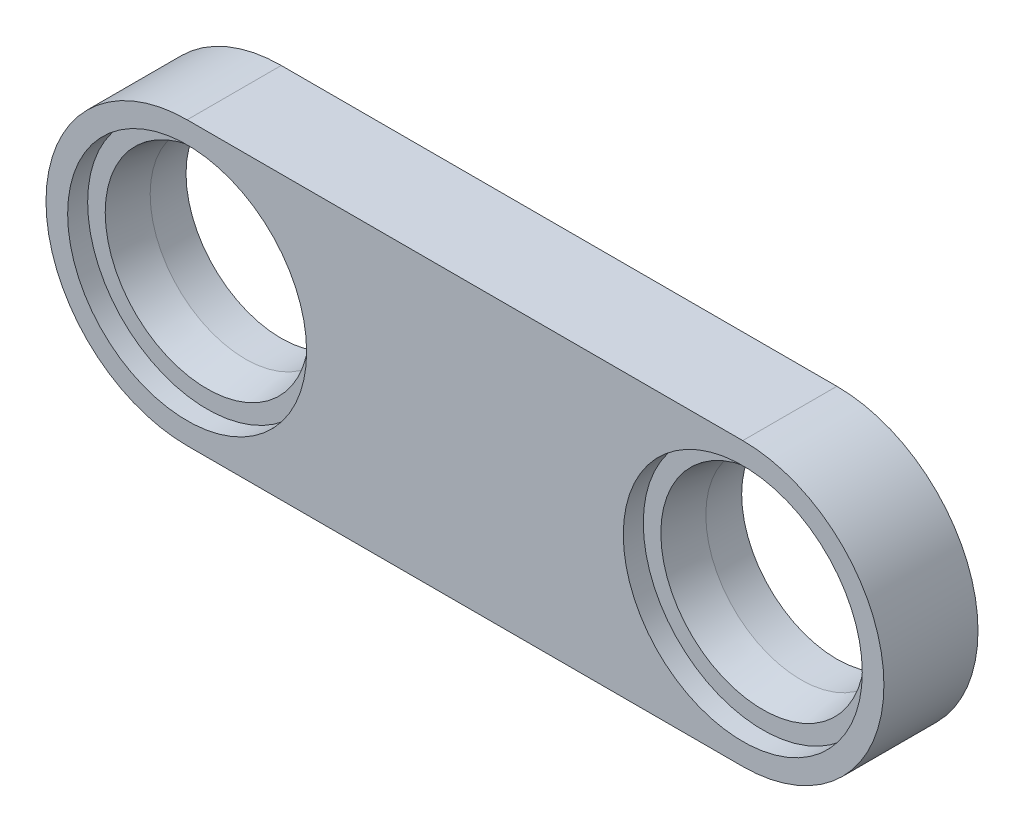
ISO-10303-21;
HEADER;
FILE_DESCRIPTION(('STEP AP214'),'2;1');
FILE_NAME('part.step','',(''),(''),'','','');
FILE_SCHEMA(('AUTOMOTIVE_DESIGN { 1 0 10303 214 1 1 1 1 }'));
ENDSEC;
DATA;
#1=APPLICATION_CONTEXT('core data for automotive mechanical design processes');
#2=APPLICATION_PROTOCOL_DEFINITION('international standard','automotive_design',2000,#1);
#3=PRODUCT_CONTEXT('',#1,'mechanical');
#4=PRODUCT('Part','Part','',(#3));
#5=PRODUCT_RELATED_PRODUCT_CATEGORY('part','',(#4));
#6=PRODUCT_DEFINITION_FORMATION('','',#4);
#7=PRODUCT_DEFINITION_CONTEXT('part definition',#1,'design');
#8=PRODUCT_DEFINITION('design','',#6,#7);
#9=PRODUCT_DEFINITION_SHAPE('','',#8);
#10=(LENGTH_UNIT() NAMED_UNIT(*) SI_UNIT(.MILLI.,.METRE.));
#11=(NAMED_UNIT(*) PLANE_ANGLE_UNIT() SI_UNIT($,.RADIAN.));
#12=(NAMED_UNIT(*) SI_UNIT($,.STERADIAN.) SOLID_ANGLE_UNIT());
#13=UNCERTAINTY_MEASURE_WITH_UNIT(LENGTH_MEASURE(1.E-05),#10,'distance_accuracy_value','');
#14=(GEOMETRIC_REPRESENTATION_CONTEXT(3) GLOBAL_UNCERTAINTY_ASSIGNED_CONTEXT((#13)) GLOBAL_UNIT_ASSIGNED_CONTEXT((#10,
#11,#12)) REPRESENTATION_CONTEXT('',''));
#15=CARTESIAN_POINT('',(0.,0.,0.));
#16=DIRECTION('',(0.,0.,1.));
#17=DIRECTION('',(1.,0.,0.));
#18=AXIS2_PLACEMENT_3D('',#15,#16,#17);
#19=CARTESIAN_POINT('',(37.4999999999996,-4.88498130835069E-12,-12.6999999999992));
#20=DIRECTION('',(0.,0.,1.));
#21=DIRECTION('',(1.00000000000001,0.,0.));
#22=AXIS2_PLACEMENT_3D('',#19,#20,#21);
#23=CYLINDRICAL_SURFACE('',#22,19.05);
#24=CARTESIAN_POINT('',(37.5000000000017,9.76996261670138E-12,1.45716771982052E-12));
#25=DIRECTION('',(0.,0.,1.));
#26=DIRECTION('',(1.00000000000001,0.,0.));
#27=AXIS2_PLACEMENT_3D('',#24,#25,#26);
#28=CIRCLE('',#27,19.05);
#29=CARTESIAN_POINT('',(37.4999999999987,-19.0500000000022,-1.66533453693773E-12));
#30=VERTEX_POINT('',#29);
#31=CARTESIAN_POINT('',(37.5000000000019,19.0500000000089,4.57966997657877E-13));
#32=VERTEX_POINT('',#31);
#33=EDGE_CURVE('E80',#30,#32,#28,.T.);
#34=ORIENTED_EDGE('',*,*,#33,.F.);
#35=DIRECTION('',(0.,0.,1.));
#36=VECTOR('',#35,1.);
#37=CARTESIAN_POINT('',(37.5000000000005,-19.0500000000045,-12.7000000000025));
#38=LINE('',#37,#36);
#39=CARTESIAN_POINT('',(37.5000000000005,-19.0500000000045,-12.7000000000025));
#40=VERTEX_POINT('',#39);
#41=EDGE_CURVE('E10',#40,#30,#38,.T.);
#42=ORIENTED_EDGE('',*,*,#41,.F.);
#43=CARTESIAN_POINT('',(37.4999999999996,-4.88498130835069E-12,-12.6999999999992));
#44=DIRECTION('',(0.,0.,1.));
#45=DIRECTION('',(1.00000000000001,0.,0.));
#46=AXIS2_PLACEMENT_3D('',#43,#44,#45);
#47=CIRCLE('',#46,19.05);
#48=CARTESIAN_POINT('',(37.5000000000006,19.0500000000058,-12.6999999999998));
#49=VERTEX_POINT('',#48);
#50=EDGE_CURVE('E73',#40,#49,#47,.T.);
#51=ORIENTED_EDGE('',*,*,#50,.T.);
#52=DIRECTION('',(0.,0.,1.));
#53=VECTOR('',#52,1.);
#54=CARTESIAN_POINT('',(37.5000000000006,19.0500000000058,-12.6999999999998));
#55=LINE('',#54,#53);
#56=EDGE_CURVE('E18',#49,#32,#55,.T.);
#57=ORIENTED_EDGE('',*,*,#56,.T.);
#58=EDGE_LOOP('',(#34,#42,#51,#57));
#59=FACE_BOUND('',#58,.T.);
#60=ADVANCED_FACE('F15',(#59),#23,.T.);
#61=CARTESIAN_POINT('',(-37.499999999999,-19.049999999996,-12.7000000000011));
#62=DIRECTION('',(0.,-0.999999999999996,0.));
#63=DIRECTION('',(1.00000000000001,0.,0.));
#64=AXIS2_PLACEMENT_3D('',#61,#62,#63);
#65=PLANE('',#64);
#66=DIRECTION('',(1.00000000000001,0.,0.));
#67=VECTOR('',#66,1.);
#68=CARTESIAN_POINT('',(-37.5000000000006,-19.049999999996,-8.74300631892311E-13));
#69=LINE('',#68,#67);
#70=CARTESIAN_POINT('',(-37.5000000000006,-19.049999999996,-8.74300631892311E-13));
#71=VERTEX_POINT('',#70);
#72=EDGE_CURVE('E75',#71,#30,#69,.T.);
#73=ORIENTED_EDGE('',*,*,#72,.F.);
#74=DIRECTION('',(0.,0.,1.));
#75=VECTOR('',#74,1.);
#76=CARTESIAN_POINT('',(-37.499999999999,-19.049999999996,-12.7000000000011));
#77=LINE('',#76,#75);
#78=CARTESIAN_POINT('',(-37.499999999999,-19.049999999996,-12.7000000000011));
#79=VERTEX_POINT('',#78);
#80=EDGE_CURVE('E24',#79,#71,#77,.T.);
#81=ORIENTED_EDGE('',*,*,#80,.F.);
#82=DIRECTION('',(1.00000000000001,0.,0.));
#83=VECTOR('',#82,1.);
#84=CARTESIAN_POINT('',(-37.499999999999,-19.049999999996,-12.7000000000011));
#85=LINE('',#84,#83);
#86=EDGE_CURVE('E70',#79,#40,#85,.T.);
#87=ORIENTED_EDGE('',*,*,#86,.T.);
#88=ORIENTED_EDGE('',*,*,#41,.T.);
#89=EDGE_LOOP('',(#73,#81,#87,#88));
#90=FACE_BOUND('',#89,.T.);
#91=ADVANCED_FACE('F91',(#90),#65,.T.);
#92=CARTESIAN_POINT('',(-37.5000000000001,0.,-12.7000000000013));
#93=DIRECTION('',(0.,0.,1.));
#94=DIRECTION('',(1.00000000000001,0.,0.));
#95=AXIS2_PLACEMENT_3D('',#92,#93,#94);
#96=CYLINDRICAL_SURFACE('',#95,19.05);
#97=CARTESIAN_POINT('',(-37.5000000000001,7.54951656745106E-12,-1.99840144432528E-12));
#98=DIRECTION('',(0.,0.,1.));
#99=DIRECTION('',(1.00000000000001,0.,0.));
#100=AXIS2_PLACEMENT_3D('',#97,#98,#99);
#101=CIRCLE('',#100,19.05);
#102=CARTESIAN_POINT('',(-37.4999999999984,19.0500000000022,-1.66533453693773E-12));
#103=VERTEX_POINT('',#102);
#104=EDGE_CURVE('E65',#103,#71,#101,.T.);
#105=ORIENTED_EDGE('',*,*,#104,.F.);
#106=DIRECTION('',(0.,0.,1.));
#107=VECTOR('',#106,1.);
#108=CARTESIAN_POINT('',(-37.5000000000016,19.050000000008,-12.7000000000006));
#109=LINE('',#108,#107);
#110=CARTESIAN_POINT('',(-37.5000000000016,19.050000000008,-12.7000000000006));
#111=VERTEX_POINT('',#110);
#112=EDGE_CURVE('E60',#111,#103,#109,.T.);
#113=ORIENTED_EDGE('',*,*,#112,.F.);
#114=CARTESIAN_POINT('',(-37.5000000000001,0.,-12.7000000000013));
#115=DIRECTION('',(0.,0.,1.));
#116=DIRECTION('',(1.00000000000001,0.,0.));
#117=AXIS2_PLACEMENT_3D('',#114,#115,#116);
#118=CIRCLE('',#117,19.05);
#119=EDGE_CURVE('E63',#111,#79,#118,.T.);
#120=ORIENTED_EDGE('',*,*,#119,.T.);
#121=ORIENTED_EDGE('',*,*,#80,.T.);
#122=EDGE_LOOP('',(#105,#113,#120,#121));
#123=FACE_BOUND('',#122,.T.);
#124=ADVANCED_FACE('F62',(#123),#96,.T.);
#125=CARTESIAN_POINT('',(-37.5000000000016,19.050000000008,-12.7000000000006));
#126=DIRECTION('',(0.,0.999999999999996,0.));
#127=DIRECTION('',(-1.00000000000001,0.,0.));
#128=AXIS2_PLACEMENT_3D('',#125,#126,#127);
#129=PLANE('',#128);
#130=DIRECTION('',(-1.00000000000001,0.,0.));
#131=VECTOR('',#130,1.);
#132=CARTESIAN_POINT('',(-37.4999999999984,19.0500000000022,-1.66533453693773E-12));
#133=LINE('',#132,#131);
#134=EDGE_CURVE('E83',#32,#103,#133,.T.);
#135=ORIENTED_EDGE('',*,*,#134,.F.);
#136=ORIENTED_EDGE('',*,*,#56,.F.);
#137=DIRECTION('',(-1.00000000000001,0.,0.));
#138=VECTOR('',#137,1.);
#139=CARTESIAN_POINT('',(-37.5000000000016,19.050000000008,-12.7000000000006));
#140=LINE('',#139,#138);
#141=EDGE_CURVE('E69',#49,#111,#140,.T.);
#142=ORIENTED_EDGE('',*,*,#141,.T.);
#143=ORIENTED_EDGE('',*,*,#112,.T.);
#144=EDGE_LOOP('',(#135,#136,#142,#143));
#145=FACE_BOUND('',#144,.T.);
#146=ADVANCED_FACE('F72',(#145),#129,.T.);
#147=CARTESIAN_POINT('',(37.4999999999996,-4.88498130835069E-12,-12.6999999999992));
#148=DIRECTION('',(0.,0.,1.));
#149=DIRECTION('',(1.00000000000001,0.,0.));
#150=AXIS2_PLACEMENT_3D('',#147,#148,#149);
#151=PLANE('',#150);
#152=CARTESIAN_POINT('',(-37.5000000000001,0.,-12.7000000000013));
#153=DIRECTION('',(0.,0.,-1.));
#154=DIRECTION('',(-1.00000000000001,0.,0.));
#155=AXIS2_PLACEMENT_3D('',#152,#153,#154);
#156=CIRCLE('',#155,12.85);
#157=CARTESIAN_POINT('',(-50.3500000000003,0.,-12.7000000000013));
#158=VERTEX_POINT('',#157);
#159=EDGE_CURVE('E163',#158,#158,#156,.T.);
#160=ORIENTED_EDGE('',*,*,#159,.F.);
#161=EDGE_LOOP('',(#160));
#162=FACE_BOUND('',#161,.T.);
#163=CARTESIAN_POINT('',(37.4999999999996,-4.88498130835069E-12,-12.6999999999992));
#164=DIRECTION('',(0.,0.,-1.));
#165=DIRECTION('',(-1.00000000000001,0.,0.));
#166=AXIS2_PLACEMENT_3D('',#163,#164,#165);
#167=CIRCLE('',#166,12.85);
#168=CARTESIAN_POINT('',(24.6499999999995,-4.89389778701721E-12,-12.6999999999992));
#169=VERTEX_POINT('',#168);
#170=EDGE_CURVE('E84',#169,#169,#167,.T.);
#171=ORIENTED_EDGE('',*,*,#170,.F.);
#172=EDGE_LOOP('',(#171));
#173=FACE_BOUND('',#172,.T.);
#174=ORIENTED_EDGE('',*,*,#50,.F.);
#175=ORIENTED_EDGE('',*,*,#86,.F.);
#176=ORIENTED_EDGE('',*,*,#119,.F.);
#177=ORIENTED_EDGE('',*,*,#141,.F.);
#178=EDGE_LOOP('',(#174,#175,#176,#177));
#179=FACE_BOUND('',#178,.T.);
#180=ADVANCED_FACE('F68',(#162,#173,#179),#151,.F.);
#181=CARTESIAN_POINT('',(37.5000000000017,9.76996261670138E-12,1.45716771982052E-12));
#182=DIRECTION('',(0.,0.,1.));
#183=DIRECTION('',(1.00000000000001,0.,0.));
#184=AXIS2_PLACEMENT_3D('',#181,#182,#183);
#185=PLANE('',#184);
#186=CARTESIAN_POINT('',(-37.5000000000001,7.54951656745106E-12,-1.99840144432528E-12));
#187=DIRECTION('',(0.,0.,-1.));
#188=DIRECTION('',(-1.00000000000001,0.,0.));
#189=AXIS2_PLACEMENT_3D('',#186,#187,#188);
#190=CIRCLE('',#189,16.13);
#191=CARTESIAN_POINT('',(-53.6300000000003,7.53832413158406E-12,-2.04854355700945E-12));
#192=VERTEX_POINT('',#191);
#193=EDGE_CURVE('E150',#192,#192,#190,.T.);
#194=ORIENTED_EDGE('',*,*,#193,.T.);
#195=EDGE_LOOP('',(#194));
#196=FACE_BOUND('',#195,.T.);
#197=CARTESIAN_POINT('',(37.5000000000017,9.76996261670138E-12,1.45716771982052E-12));
#198=DIRECTION('',(0.,0.,-1.));
#199=DIRECTION('',(-1.00000000000001,0.,0.));
#200=AXIS2_PLACEMENT_3D('',#197,#198,#199);
#201=CIRCLE('',#200,16.13);
#202=CARTESIAN_POINT('',(21.3700000000015,9.75877018083438E-12,1.40702560713635E-12));
#203=VERTEX_POINT('',#202);
#204=EDGE_CURVE('E166',#203,#203,#201,.T.);
#205=ORIENTED_EDGE('',*,*,#204,.T.);
#206=EDGE_LOOP('',(#205));
#207=FACE_BOUND('',#206,.T.);
#208=ORIENTED_EDGE('',*,*,#33,.T.);
#209=ORIENTED_EDGE('',*,*,#134,.T.);
#210=ORIENTED_EDGE('',*,*,#104,.T.);
#211=ORIENTED_EDGE('',*,*,#72,.T.);
#212=EDGE_LOOP('',(#208,#209,#210,#211));
#213=FACE_BOUND('',#212,.T.);
#214=ADVANCED_FACE('F90',(#196,#207,#213),#185,.T.);
#215=CARTESIAN_POINT('',(37.5000000000017,9.76996261670138E-12,1.45716771982052E-12));
#216=DIRECTION('',(0.,0.,-1.));
#217=DIRECTION('',(-1.00000000000001,0.,0.));
#218=AXIS2_PLACEMENT_3D('',#215,#216,#217);
#219=CYLINDRICAL_SURFACE('',#218,12.85);
#220=CARTESIAN_POINT('',(37.4999999999994,-4.44089209850063E-13,-7.86086645585114));
#221=DIRECTION('',(0.,0.,-1.));
#222=DIRECTION('',(-1.00000000000001,0.,0.));
#223=AXIS2_PLACEMENT_3D('',#220,#221,#222);
#224=CIRCLE('',#223,12.85);
#225=CARTESIAN_POINT('',(24.6499999999992,-4.53005688516583E-13,-7.86086645585118));
#226=VERTEX_POINT('',#225);
#227=EDGE_CURVE('E175',#226,#226,#224,.T.);
#228=ORIENTED_EDGE('',*,*,#227,.F.);
#229=EDGE_LOOP('',(#228));
#230=FACE_BOUND('',#229,.T.);
#231=ORIENTED_EDGE('',*,*,#170,.T.);
#232=EDGE_LOOP('',(#231));
#233=FACE_BOUND('',#232,.T.);
#234=ADVANCED_FACE('F110',(#230,#233),#219,.F.);
#235=CARTESIAN_POINT('',(37.4999999999994,-4.44089209850063E-13,-7.86086645585114));
#236=DIRECTION('',(0.,0.,1.));
#237=DIRECTION('',(1.00000000000001,0.,0.));
#238=AXIS2_PLACEMENT_3D('',#235,#236,#237);
#239=CONICAL_SURFACE('',#238,12.85,0.174532925199434);
#240=CARTESIAN_POINT('',(37.4999999999983,1.33226762955019E-12,-2.70000000000026));
#241=DIRECTION('',(0.,0.,-1.));
#242=DIRECTION('',(-1.00000000000001,0.,0.));
#243=AXIS2_PLACEMENT_3D('',#240,#241,#242);
#244=CIRCLE('',#243,13.76);
#245=CARTESIAN_POINT('',(23.7399999999981,1.32271971153841E-12,-2.7000000000003));
#246=VERTEX_POINT('',#245);
#247=EDGE_CURVE('E172',#246,#246,#244,.T.);
#248=ORIENTED_EDGE('',*,*,#247,.F.);
#249=EDGE_LOOP('',(#248));
#250=FACE_BOUND('',#249,.T.);
#251=ORIENTED_EDGE('',*,*,#227,.T.);
#252=EDGE_LOOP('',(#251));
#253=FACE_BOUND('',#252,.T.);
#254=ADVANCED_FACE('F117',(#250,#253),#239,.F.);
#255=CARTESIAN_POINT('',(51.2600000000015,-6.66133814775094E-12,-2.70000000000069));
#256=DIRECTION('',(0.,0.,-1.));
#257=DIRECTION('',(-1.00000000000001,0.,0.));
#258=AXIS2_PLACEMENT_3D('',#255,#256,#257);
#259=PLANE('',#258);
#260=CARTESIAN_POINT('',(37.4999999999983,1.33226762955019E-12,-2.70000000000026));
#261=DIRECTION('',(0.,0.,-1.));
#262=DIRECTION('',(-1.00000000000001,0.,0.));
#263=AXIS2_PLACEMENT_3D('',#260,#261,#262);
#264=CIRCLE('',#263,16.13);
#265=CARTESIAN_POINT('',(21.3699999999981,1.32107519368319E-12,-2.70000000000031));
#266=VERTEX_POINT('',#265);
#267=EDGE_CURVE('E169',#266,#266,#264,.T.);
#268=ORIENTED_EDGE('',*,*,#267,.F.);
#269=EDGE_LOOP('',(#268));
#270=FACE_BOUND('',#269,.T.);
#271=ORIENTED_EDGE('',*,*,#247,.T.);
#272=EDGE_LOOP('',(#271));
#273=FACE_BOUND('',#272,.T.);
#274=ADVANCED_FACE('F121',(#270,#273),#259,.F.);
#275=CARTESIAN_POINT('',(37.5000000000017,9.76996261670138E-12,1.45716771982052E-12));
#276=DIRECTION('',(0.,0.,-1.));
#277=DIRECTION('',(-1.00000000000001,0.,0.));
#278=AXIS2_PLACEMENT_3D('',#275,#276,#277);
#279=CYLINDRICAL_SURFACE('',#278,16.13);
#280=ORIENTED_EDGE('',*,*,#204,.F.);
#281=EDGE_LOOP('',(#280));
#282=FACE_BOUND('',#281,.T.);
#283=ORIENTED_EDGE('',*,*,#267,.T.);
#284=EDGE_LOOP('',(#283));
#285=FACE_BOUND('',#284,.T.);
#286=ADVANCED_FACE('F125',(#282,#285),#279,.F.);
#287=CARTESIAN_POINT('',(-37.5000000000001,7.54951656745106E-12,-1.99840144432528E-12));
#288=DIRECTION('',(0.,0.,-1.));
#289=DIRECTION('',(-1.00000000000001,0.,0.));
#290=AXIS2_PLACEMENT_3D('',#287,#288,#289);
#291=CYLINDRICAL_SURFACE('',#290,12.85);
#292=CARTESIAN_POINT('',(-37.4999999999998,1.77635683940025E-12,-7.86086645585327));
#293=DIRECTION('',(0.,0.,-1.));
#294=DIRECTION('',(-1.00000000000001,0.,0.));
#295=AXIS2_PLACEMENT_3D('',#292,#293,#294);
#296=CIRCLE('',#295,12.85);
#297=CARTESIAN_POINT('',(-50.3499999999999,1.76744036073373E-12,-7.86086645585331));
#298=VERTEX_POINT('',#297);
#299=EDGE_CURVE('E157',#298,#298,#296,.T.);
#300=ORIENTED_EDGE('',*,*,#299,.F.);
#301=EDGE_LOOP('',(#300));
#302=FACE_BOUND('',#301,.T.);
#303=ORIENTED_EDGE('',*,*,#159,.T.);
#304=EDGE_LOOP('',(#303));
#305=FACE_BOUND('',#304,.T.);
#306=ADVANCED_FACE('F129',(#302,#305),#291,.F.);
#307=CARTESIAN_POINT('',(-37.4999999999998,1.77635683940025E-12,-7.86086645585327));
#308=DIRECTION('',(0.,0.,1.));
#309=DIRECTION('',(1.00000000000001,0.,0.));
#310=AXIS2_PLACEMENT_3D('',#307,#308,#309);
#311=CONICAL_SURFACE('',#310,12.85,0.174532925199434);
#312=CARTESIAN_POINT('',(-37.4999999999993,2.66453525910038E-12,-2.7000000000007));
#313=DIRECTION('',(0.,0.,-1.));
#314=DIRECTION('',(-1.00000000000001,0.,0.));
#315=AXIS2_PLACEMENT_3D('',#312,#313,#314);
#316=CIRCLE('',#315,13.76);
#317=CARTESIAN_POINT('',(-51.2599999999994,2.6549873410886E-12,-2.70000000000074));
#318=VERTEX_POINT('',#317);
#319=EDGE_CURVE('E154',#318,#318,#316,.T.);
#320=ORIENTED_EDGE('',*,*,#319,.F.);
#321=EDGE_LOOP('',(#320));
#322=FACE_BOUND('',#321,.T.);
#323=ORIENTED_EDGE('',*,*,#299,.T.);
#324=EDGE_LOOP('',(#323));
#325=FACE_BOUND('',#324,.T.);
#326=ADVANCED_FACE('F133',(#322,#325),#311,.F.);
#327=CARTESIAN_POINT('',(-23.7400000000023,-5.77315972805081E-12,-2.70000000000004));
#328=DIRECTION('',(0.,0.,-1.));
#329=DIRECTION('',(-1.00000000000001,0.,0.));
#330=AXIS2_PLACEMENT_3D('',#327,#328,#329);
#331=PLANE('',#330);
#332=CARTESIAN_POINT('',(-37.4999999999993,2.66453525910038E-12,-2.7000000000007));
#333=DIRECTION('',(0.,0.,-1.));
#334=DIRECTION('',(-1.00000000000001,0.,0.));
#335=AXIS2_PLACEMENT_3D('',#332,#333,#334);
#336=CIRCLE('',#335,16.13);
#337=CARTESIAN_POINT('',(-53.6299999999994,2.65334282323337E-12,-2.70000000000075));
#338=VERTEX_POINT('',#337);
#339=EDGE_CURVE('E153',#338,#338,#336,.T.);
#340=ORIENTED_EDGE('',*,*,#339,.F.);
#341=EDGE_LOOP('',(#340));
#342=FACE_BOUND('',#341,.T.);
#343=ORIENTED_EDGE('',*,*,#319,.T.);
#344=EDGE_LOOP('',(#343));
#345=FACE_BOUND('',#344,.T.);
#346=ADVANCED_FACE('F137',(#342,#345),#331,.F.);
#347=CARTESIAN_POINT('',(-37.5000000000001,7.54951656745106E-12,-1.99840144432528E-12));
#348=DIRECTION('',(0.,0.,-1.));
#349=DIRECTION('',(-1.00000000000001,0.,0.));
#350=AXIS2_PLACEMENT_3D('',#347,#348,#349);
#351=CYLINDRICAL_SURFACE('',#350,16.13);
#352=ORIENTED_EDGE('',*,*,#193,.F.);
#353=EDGE_LOOP('',(#352));
#354=FACE_BOUND('',#353,.T.);
#355=ORIENTED_EDGE('',*,*,#339,.T.);
#356=EDGE_LOOP('',(#355));
#357=FACE_BOUND('',#356,.T.);
#358=ADVANCED_FACE('F141',(#354,#357),#351,.F.);
#359=CLOSED_SHELL('',(#60,#91,#124,#146,#180,#214,#234,#254,#274,#286,#306,#326,#346,#358));
#360=MANIFOLD_SOLID_BREP('B1',#359);
#361=ADVANCED_BREP_SHAPE_REPRESENTATION('',(#18,#360),#14);
#362=SHAPE_DEFINITION_REPRESENTATION(#9,#361);
ENDSEC;
END-ISO-10303-21;
